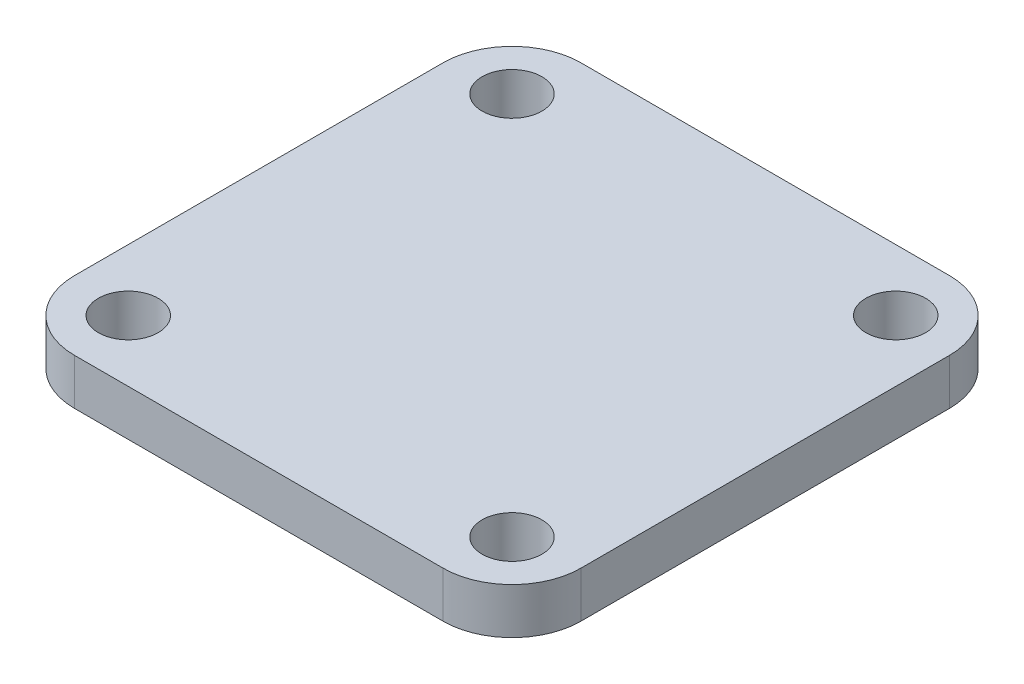
ISO-10303-21;
HEADER;
FILE_DESCRIPTION(('STEP AP214'),'2;1');
FILE_NAME('part.step','',(''),(''),'','','');
FILE_SCHEMA(('AUTOMOTIVE_DESIGN { 1 0 10303 214 1 1 1 1 }'));
ENDSEC;
DATA;
#1=APPLICATION_CONTEXT('core data for automotive mechanical design processes');
#2=APPLICATION_PROTOCOL_DEFINITION('international standard','automotive_design',2000,#1);
#3=PRODUCT_CONTEXT('',#1,'mechanical');
#4=PRODUCT('Part','Part','',(#3));
#5=PRODUCT_RELATED_PRODUCT_CATEGORY('part','',(#4));
#6=PRODUCT_DEFINITION_FORMATION('','',#4);
#7=PRODUCT_DEFINITION_CONTEXT('part definition',#1,'design');
#8=PRODUCT_DEFINITION('design','',#6,#7);
#9=PRODUCT_DEFINITION_SHAPE('','',#8);
#10=(LENGTH_UNIT() NAMED_UNIT(*) SI_UNIT(.MILLI.,.METRE.));
#11=(NAMED_UNIT(*) PLANE_ANGLE_UNIT() SI_UNIT($,.RADIAN.));
#12=(NAMED_UNIT(*) SI_UNIT($,.STERADIAN.) SOLID_ANGLE_UNIT());
#13=UNCERTAINTY_MEASURE_WITH_UNIT(LENGTH_MEASURE(1.E-05),#10,'distance_accuracy_value','');
#14=(GEOMETRIC_REPRESENTATION_CONTEXT(3) GLOBAL_UNCERTAINTY_ASSIGNED_CONTEXT((#13)) GLOBAL_UNIT_ASSIGNED_CONTEXT((#10,
#11,#12)) REPRESENTATION_CONTEXT('',''));
#15=CARTESIAN_POINT('',(0.,0.,0.));
#16=DIRECTION('',(0.,0.,1.));
#17=DIRECTION('',(1.,0.,0.));
#18=AXIS2_PLACEMENT_3D('',#15,#16,#17);
#19=CARTESIAN_POINT('',(0.,5.,0.));
#20=DIRECTION('',(0.,-1.,0.));
#21=DIRECTION('',(0.,0.,-1.));
#22=AXIS2_PLACEMENT_3D('',#19,#20,#21);
#23=PLANE('',#22);
#24=DIRECTION('',(-1.,0.,0.));
#25=VECTOR('',#24,1.);
#26=CARTESIAN_POINT('',(-27.55,5.,-27.55));
#27=LINE('',#26,#25);
#28=CARTESIAN_POINT('',(20.05,5.,-27.55));
#29=VERTEX_POINT('',#28);
#30=CARTESIAN_POINT('',(-20.05,5.,-27.55));
#31=VERTEX_POINT('',#30);
#32=EDGE_CURVE('E194',#29,#31,#27,.T.);
#33=ORIENTED_EDGE('',*,*,#32,.T.);
#34=CARTESIAN_POINT('',(-20.05,5.,-20.05));
#35=DIRECTION('',(0.,-1.,0.));
#36=DIRECTION('',(0.,0.,-1.));
#37=AXIS2_PLACEMENT_3D('',#34,#35,#36);
#38=CIRCLE('',#37,7.5);
#39=CARTESIAN_POINT('',(-27.55,5.,-20.05));
#40=VERTEX_POINT('',#39);
#41=EDGE_CURVE('E170',#31,#40,#38,.F.);
#42=ORIENTED_EDGE('',*,*,#41,.T.);
#43=DIRECTION('',(0.,0.,1.));
#44=VECTOR('',#43,1.);
#45=CARTESIAN_POINT('',(-27.55,5.,27.55));
#46=LINE('',#45,#44);
#47=CARTESIAN_POINT('',(-27.55,5.,20.05));
#48=VERTEX_POINT('',#47);
#49=EDGE_CURVE('E127',#40,#48,#46,.T.);
#50=ORIENTED_EDGE('',*,*,#49,.T.);
#51=CARTESIAN_POINT('',(-20.05,5.,20.05));
#52=DIRECTION('',(0.,-1.,0.));
#53=DIRECTION('',(0.,0.,-1.));
#54=AXIS2_PLACEMENT_3D('',#51,#52,#53);
#55=CIRCLE('',#54,7.5);
#56=CARTESIAN_POINT('',(-20.05,5.,27.55));
#57=VERTEX_POINT('',#56);
#58=EDGE_CURVE('E62',#48,#57,#55,.F.);
#59=ORIENTED_EDGE('',*,*,#58,.T.);
#60=DIRECTION('',(1.,0.,0.));
#61=VECTOR('',#60,1.);
#62=CARTESIAN_POINT('',(-27.55,5.,27.55));
#63=LINE('',#62,#61);
#64=CARTESIAN_POINT('',(20.05,5.,27.55));
#65=VERTEX_POINT('',#64);
#66=EDGE_CURVE('E148',#57,#65,#63,.T.);
#67=ORIENTED_EDGE('',*,*,#66,.T.);
#68=CARTESIAN_POINT('',(20.05,5.,20.05));
#69=DIRECTION('',(0.,-1.,0.));
#70=DIRECTION('',(0.,0.,-1.));
#71=AXIS2_PLACEMENT_3D('',#68,#69,#70);
#72=CIRCLE('',#71,7.5);
#73=CARTESIAN_POINT('',(27.55,5.,20.05));
#74=VERTEX_POINT('',#73);
#75=EDGE_CURVE('E165',#65,#74,#72,.F.);
#76=ORIENTED_EDGE('',*,*,#75,.T.);
#77=DIRECTION('',(0.,0.,-1.));
#78=VECTOR('',#77,1.);
#79=CARTESIAN_POINT('',(27.55,5.,27.55));
#80=LINE('',#79,#78);
#81=CARTESIAN_POINT('',(27.55,5.,-20.05));
#82=VERTEX_POINT('',#81);
#83=EDGE_CURVE('E141',#74,#82,#80,.T.);
#84=ORIENTED_EDGE('',*,*,#83,.T.);
#85=CARTESIAN_POINT('',(20.05,5.,-20.05));
#86=DIRECTION('',(0.,-1.,0.));
#87=DIRECTION('',(0.,0.,-1.));
#88=AXIS2_PLACEMENT_3D('',#85,#86,#87);
#89=CIRCLE('',#88,7.5);
#90=EDGE_CURVE('E162',#82,#29,#89,.F.);
#91=ORIENTED_EDGE('',*,*,#90,.T.);
#92=EDGE_LOOP('',(#33,#42,#50,#59,#67,#76,#84,#91));
#93=FACE_BOUND('',#92,.T.);
#94=CARTESIAN_POINT('',(20.87,5.,20.87));
#95=DIRECTION('',(0.,1.,0.));
#96=DIRECTION('',(0.,0.,1.));
#97=AXIS2_PLACEMENT_3D('',#94,#95,#96);
#98=CIRCLE('',#97,3.25);
#99=CARTESIAN_POINT('',(20.87,5.,24.12));
#100=VERTEX_POINT('',#99);
#101=EDGE_CURVE('E200',#100,#100,#98,.T.);
#102=ORIENTED_EDGE('',*,*,#101,.F.);
#103=EDGE_LOOP('',(#102));
#104=FACE_BOUND('',#103,.T.);
#105=CARTESIAN_POINT('',(-20.87,5.,20.87));
#106=DIRECTION('',(0.,1.,0.));
#107=DIRECTION('',(0.,0.,1.));
#108=AXIS2_PLACEMENT_3D('',#105,#106,#107);
#109=CIRCLE('',#108,3.25);
#110=CARTESIAN_POINT('',(-20.87,5.,24.12));
#111=VERTEX_POINT('',#110);
#112=EDGE_CURVE('E214',#111,#111,#109,.T.);
#113=ORIENTED_EDGE('',*,*,#112,.F.);
#114=EDGE_LOOP('',(#113));
#115=FACE_BOUND('',#114,.T.);
#116=CARTESIAN_POINT('',(-20.87,5.,-20.87));
#117=DIRECTION('',(0.,1.,0.));
#118=DIRECTION('',(0.,0.,1.));
#119=AXIS2_PLACEMENT_3D('',#116,#117,#118);
#120=CIRCLE('',#119,3.25);
#121=CARTESIAN_POINT('',(-20.87,5.,-17.62));
#122=VERTEX_POINT('',#121);
#123=EDGE_CURVE('E220',#122,#122,#120,.T.);
#124=ORIENTED_EDGE('',*,*,#123,.F.);
#125=EDGE_LOOP('',(#124));
#126=FACE_BOUND('',#125,.T.);
#127=CARTESIAN_POINT('',(20.87,5.,-20.87));
#128=DIRECTION('',(0.,1.,0.));
#129=DIRECTION('',(0.,0.,1.));
#130=AXIS2_PLACEMENT_3D('',#127,#128,#129);
#131=CIRCLE('',#130,3.25);
#132=CARTESIAN_POINT('',(20.87,5.,-17.62));
#133=VERTEX_POINT('',#132);
#134=EDGE_CURVE('E228',#133,#133,#131,.T.);
#135=ORIENTED_EDGE('',*,*,#134,.F.);
#136=EDGE_LOOP('',(#135));
#137=FACE_BOUND('',#136,.T.);
#138=ADVANCED_FACE('F39',(#93,#104,#115,#126,#137),#23,.F.);
#139=CARTESIAN_POINT('',(0.,0.,0.));
#140=DIRECTION('',(0.,-1.,0.));
#141=DIRECTION('',(0.,0.,-1.));
#142=AXIS2_PLACEMENT_3D('',#139,#140,#141);
#143=PLANE('',#142);
#144=CARTESIAN_POINT('',(-20.87,0.,-20.87));
#145=DIRECTION('',(0.,1.,0.));
#146=DIRECTION('',(0.,0.,1.));
#147=AXIS2_PLACEMENT_3D('',#144,#145,#146);
#148=CIRCLE('',#147,3.25);
#149=CARTESIAN_POINT('',(-20.87,0.,-17.62));
#150=VERTEX_POINT('',#149);
#151=EDGE_CURVE('E224',#150,#150,#148,.T.);
#152=ORIENTED_EDGE('',*,*,#151,.T.);
#153=EDGE_LOOP('',(#152));
#154=FACE_BOUND('',#153,.T.);
#155=CARTESIAN_POINT('',(20.87,0.,20.87));
#156=DIRECTION('',(0.,1.,0.));
#157=DIRECTION('',(0.,0.,1.));
#158=AXIS2_PLACEMENT_3D('',#155,#156,#157);
#159=CIRCLE('',#158,3.25);
#160=CARTESIAN_POINT('',(20.87,0.,24.12));
#161=VERTEX_POINT('',#160);
#162=EDGE_CURVE('E203',#161,#161,#159,.T.);
#163=ORIENTED_EDGE('',*,*,#162,.T.);
#164=EDGE_LOOP('',(#163));
#165=FACE_BOUND('',#164,.T.);
#166=DIRECTION('',(0.,0.,1.));
#167=VECTOR('',#166,1.);
#168=CARTESIAN_POINT('',(-27.55,0.,27.55));
#169=LINE('',#168,#167);
#170=CARTESIAN_POINT('',(-27.55,0.,-20.05));
#171=VERTEX_POINT('',#170);
#172=CARTESIAN_POINT('',(-27.55,0.,20.05));
#173=VERTEX_POINT('',#172);
#174=EDGE_CURVE('E125',#171,#173,#169,.T.);
#175=ORIENTED_EDGE('',*,*,#174,.F.);
#176=CARTESIAN_POINT('',(-20.05,0.,-20.05));
#177=DIRECTION('',(0.,-1.,0.));
#178=DIRECTION('',(0.,0.,-1.));
#179=AXIS2_PLACEMENT_3D('',#176,#177,#178);
#180=CIRCLE('',#179,7.5);
#181=CARTESIAN_POINT('',(-20.05,0.,-27.55));
#182=VERTEX_POINT('',#181);
#183=EDGE_CURVE('E107',#171,#182,#180,.T.);
#184=ORIENTED_EDGE('',*,*,#183,.T.);
#185=DIRECTION('',(-1.,0.,0.));
#186=VECTOR('',#185,1.);
#187=CARTESIAN_POINT('',(-27.55,0.,-27.55));
#188=LINE('',#187,#186);
#189=CARTESIAN_POINT('',(20.05,0.,-27.55));
#190=VERTEX_POINT('',#189);
#191=EDGE_CURVE('E137',#190,#182,#188,.T.);
#192=ORIENTED_EDGE('',*,*,#191,.F.);
#193=CARTESIAN_POINT('',(20.05,0.,-20.05));
#194=DIRECTION('',(0.,-1.,0.));
#195=DIRECTION('',(0.,0.,-1.));
#196=AXIS2_PLACEMENT_3D('',#193,#194,#195);
#197=CIRCLE('',#196,7.5);
#198=CARTESIAN_POINT('',(27.55,0.,-20.05));
#199=VERTEX_POINT('',#198);
#200=EDGE_CURVE('E129',#190,#199,#197,.T.);
#201=ORIENTED_EDGE('',*,*,#200,.T.);
#202=DIRECTION('',(0.,0.,-1.));
#203=VECTOR('',#202,1.);
#204=CARTESIAN_POINT('',(27.55,0.,27.55));
#205=LINE('',#204,#203);
#206=CARTESIAN_POINT('',(27.55,0.,20.05));
#207=VERTEX_POINT('',#206);
#208=EDGE_CURVE('E143',#207,#199,#205,.T.);
#209=ORIENTED_EDGE('',*,*,#208,.F.);
#210=CARTESIAN_POINT('',(20.05,0.,20.05));
#211=DIRECTION('',(0.,-1.,0.));
#212=DIRECTION('',(0.,0.,-1.));
#213=AXIS2_PLACEMENT_3D('',#210,#211,#212);
#214=CIRCLE('',#213,7.5);
#215=CARTESIAN_POINT('',(20.05,0.,27.55));
#216=VERTEX_POINT('',#215);
#217=EDGE_CURVE('E152',#207,#216,#214,.T.);
#218=ORIENTED_EDGE('',*,*,#217,.T.);
#219=DIRECTION('',(1.,0.,0.));
#220=VECTOR('',#219,1.);
#221=CARTESIAN_POINT('',(-27.55,0.,27.55));
#222=LINE('',#221,#220);
#223=CARTESIAN_POINT('',(-20.05,0.,27.55));
#224=VERTEX_POINT('',#223);
#225=EDGE_CURVE('E136',#224,#216,#222,.T.);
#226=ORIENTED_EDGE('',*,*,#225,.F.);
#227=CARTESIAN_POINT('',(-20.05,0.,20.05));
#228=DIRECTION('',(0.,-1.,0.));
#229=DIRECTION('',(0.,0.,-1.));
#230=AXIS2_PLACEMENT_3D('',#227,#228,#229);
#231=CIRCLE('',#230,7.5);
#232=EDGE_CURVE('E119',#224,#173,#231,.T.);
#233=ORIENTED_EDGE('',*,*,#232,.T.);
#234=EDGE_LOOP('',(#175,#184,#192,#201,#209,#218,#226,#233));
#235=FACE_BOUND('',#234,.T.);
#236=CARTESIAN_POINT('',(-20.87,0.,20.87));
#237=DIRECTION('',(0.,1.,0.));
#238=DIRECTION('',(0.,0.,1.));
#239=AXIS2_PLACEMENT_3D('',#236,#237,#238);
#240=CIRCLE('',#239,3.25);
#241=CARTESIAN_POINT('',(-20.87,0.,24.12));
#242=VERTEX_POINT('',#241);
#243=EDGE_CURVE('E216',#242,#242,#240,.T.);
#244=ORIENTED_EDGE('',*,*,#243,.T.);
#245=EDGE_LOOP('',(#244));
#246=FACE_BOUND('',#245,.T.);
#247=CARTESIAN_POINT('',(20.87,0.,-20.87));
#248=DIRECTION('',(0.,1.,0.));
#249=DIRECTION('',(0.,0.,1.));
#250=AXIS2_PLACEMENT_3D('',#247,#248,#249);
#251=CIRCLE('',#250,3.25);
#252=CARTESIAN_POINT('',(20.87,0.,-17.62));
#253=VERTEX_POINT('',#252);
#254=EDGE_CURVE('E232',#253,#253,#251,.T.);
#255=ORIENTED_EDGE('',*,*,#254,.T.);
#256=EDGE_LOOP('',(#255));
#257=FACE_BOUND('',#256,.T.);
#258=ADVANCED_FACE('F132',(#154,#165,#235,#246,#257),#143,.T.);
#259=CARTESIAN_POINT('',(27.55,5.,27.55));
#260=DIRECTION('',(-1.,0.,0.));
#261=DIRECTION('',(0.,0.,1.));
#262=AXIS2_PLACEMENT_3D('',#259,#260,#261);
#263=PLANE('',#262);
#264=ORIENTED_EDGE('',*,*,#83,.F.);
#265=DIRECTION('',(0.,-1.,0.));
#266=VECTOR('',#265,1.);
#267=CARTESIAN_POINT('',(27.55,5.,20.05));
#268=LINE('',#267,#266);
#269=EDGE_CURVE('E11',#74,#207,#268,.T.);
#270=ORIENTED_EDGE('',*,*,#269,.T.);
#271=ORIENTED_EDGE('',*,*,#208,.T.);
#272=DIRECTION('',(0.,-1.,0.));
#273=VECTOR('',#272,1.);
#274=CARTESIAN_POINT('',(27.55,5.,-20.05));
#275=LINE('',#274,#273);
#276=EDGE_CURVE('E48',#199,#82,#275,.F.);
#277=ORIENTED_EDGE('',*,*,#276,.T.);
#278=EDGE_LOOP('',(#264,#270,#271,#277));
#279=FACE_BOUND('',#278,.T.);
#280=ADVANCED_FACE('F184',(#279),#263,.F.);
#281=CARTESIAN_POINT('',(-27.55,5.,-27.55));
#282=DIRECTION('',(0.,0.,1.));
#283=DIRECTION('',(1.,0.,0.));
#284=AXIS2_PLACEMENT_3D('',#281,#282,#283);
#285=PLANE('',#284);
#286=ORIENTED_EDGE('',*,*,#191,.T.);
#287=DIRECTION('',(0.,-1.,0.));
#288=VECTOR('',#287,1.);
#289=CARTESIAN_POINT('',(-20.05,5.,-27.55));
#290=LINE('',#289,#288);
#291=EDGE_CURVE('E112',#182,#31,#290,.F.);
#292=ORIENTED_EDGE('',*,*,#291,.T.);
#293=ORIENTED_EDGE('',*,*,#32,.F.);
#294=DIRECTION('',(0.,-1.,0.));
#295=VECTOR('',#294,1.);
#296=CARTESIAN_POINT('',(20.05,5.,-27.55));
#297=LINE('',#296,#295);
#298=EDGE_CURVE('E118',#29,#190,#297,.T.);
#299=ORIENTED_EDGE('',*,*,#298,.T.);
#300=EDGE_LOOP('',(#286,#292,#293,#299));
#301=FACE_BOUND('',#300,.T.);
#302=ADVANCED_FACE('F198',(#301),#285,.F.);
#303=CARTESIAN_POINT('',(-27.55,5.,27.55));
#304=DIRECTION('',(1.,0.,0.));
#305=DIRECTION('',(0.,0.,-1.));
#306=AXIS2_PLACEMENT_3D('',#303,#304,#305);
#307=PLANE('',#306);
#308=ORIENTED_EDGE('',*,*,#49,.F.);
#309=DIRECTION('',(0.,-1.,0.));
#310=VECTOR('',#309,1.);
#311=CARTESIAN_POINT('',(-27.55,5.,-20.05));
#312=LINE('',#311,#310);
#313=EDGE_CURVE('E111',#40,#171,#312,.T.);
#314=ORIENTED_EDGE('',*,*,#313,.T.);
#315=ORIENTED_EDGE('',*,*,#174,.T.);
#316=DIRECTION('',(0.,-1.,0.));
#317=VECTOR('',#316,1.);
#318=CARTESIAN_POINT('',(-27.55,5.,20.05));
#319=LINE('',#318,#317);
#320=EDGE_CURVE('E130',#173,#48,#319,.F.);
#321=ORIENTED_EDGE('',*,*,#320,.T.);
#322=EDGE_LOOP('',(#308,#314,#315,#321));
#323=FACE_BOUND('',#322,.T.);
#324=ADVANCED_FACE('F124',(#323),#307,.F.);
#325=CARTESIAN_POINT('',(-27.55,5.,27.55));
#326=DIRECTION('',(0.,0.,-1.));
#327=DIRECTION('',(-1.,0.,0.));
#328=AXIS2_PLACEMENT_3D('',#325,#326,#327);
#329=PLANE('',#328);
#330=ORIENTED_EDGE('',*,*,#66,.F.);
#331=DIRECTION('',(0.,-1.,0.));
#332=VECTOR('',#331,1.);
#333=CARTESIAN_POINT('',(-20.05,5.,27.55));
#334=LINE('',#333,#332);
#335=EDGE_CURVE('E175',#57,#224,#334,.T.);
#336=ORIENTED_EDGE('',*,*,#335,.T.);
#337=ORIENTED_EDGE('',*,*,#225,.T.);
#338=DIRECTION('',(0.,-1.,0.));
#339=VECTOR('',#338,1.);
#340=CARTESIAN_POINT('',(20.05,5.,27.55));
#341=LINE('',#340,#339);
#342=EDGE_CURVE('E55',#216,#65,#341,.F.);
#343=ORIENTED_EDGE('',*,*,#342,.T.);
#344=EDGE_LOOP('',(#330,#336,#337,#343));
#345=FACE_BOUND('',#344,.T.);
#346=ADVANCED_FACE('F254',(#345),#329,.F.);
#347=CARTESIAN_POINT('',(20.87,5.,20.87));
#348=DIRECTION('',(0.,-1.,0.));
#349=DIRECTION('',(0.,0.,-1.));
#350=AXIS2_PLACEMENT_3D('',#347,#348,#349);
#351=CYLINDRICAL_SURFACE('',#350,3.25);
#352=ORIENTED_EDGE('',*,*,#101,.T.);
#353=EDGE_LOOP('',(#352));
#354=FACE_BOUND('',#353,.T.);
#355=ORIENTED_EDGE('',*,*,#162,.F.);
#356=EDGE_LOOP('',(#355));
#357=FACE_BOUND('',#356,.T.);
#358=ADVANCED_FACE('F251',(#354,#357),#351,.F.);
#359=CARTESIAN_POINT('',(-20.87,5.,20.87));
#360=DIRECTION('',(0.,-1.,0.));
#361=DIRECTION('',(0.,0.,-1.));
#362=AXIS2_PLACEMENT_3D('',#359,#360,#361);
#363=CYLINDRICAL_SURFACE('',#362,3.25);
#364=ORIENTED_EDGE('',*,*,#112,.T.);
#365=EDGE_LOOP('',(#364));
#366=FACE_BOUND('',#365,.T.);
#367=ORIENTED_EDGE('',*,*,#243,.F.);
#368=EDGE_LOOP('',(#367));
#369=FACE_BOUND('',#368,.T.);
#370=ADVANCED_FACE('F346',(#366,#369),#363,.F.);
#371=CARTESIAN_POINT('',(-20.87,5.,-20.87));
#372=DIRECTION('',(0.,-1.,0.));
#373=DIRECTION('',(0.,0.,-1.));
#374=AXIS2_PLACEMENT_3D('',#371,#372,#373);
#375=CYLINDRICAL_SURFACE('',#374,3.25);
#376=ORIENTED_EDGE('',*,*,#123,.T.);
#377=EDGE_LOOP('',(#376));
#378=FACE_BOUND('',#377,.T.);
#379=ORIENTED_EDGE('',*,*,#151,.F.);
#380=EDGE_LOOP('',(#379));
#381=FACE_BOUND('',#380,.T.);
#382=ADVANCED_FACE('F337',(#378,#381),#375,.F.);
#383=CARTESIAN_POINT('',(20.87,5.,-20.87));
#384=DIRECTION('',(0.,-1.,0.));
#385=DIRECTION('',(0.,0.,-1.));
#386=AXIS2_PLACEMENT_3D('',#383,#384,#385);
#387=CYLINDRICAL_SURFACE('',#386,3.25);
#388=ORIENTED_EDGE('',*,*,#134,.T.);
#389=EDGE_LOOP('',(#388));
#390=FACE_BOUND('',#389,.T.);
#391=ORIENTED_EDGE('',*,*,#254,.F.);
#392=EDGE_LOOP('',(#391));
#393=FACE_BOUND('',#392,.T.);
#394=ADVANCED_FACE('F240',(#390,#393),#387,.F.);
#395=CARTESIAN_POINT('',(-20.05,5.,-20.05));
#396=DIRECTION('',(0.,-1.,0.));
#397=DIRECTION('',(0.,0.,-1.));
#398=AXIS2_PLACEMENT_3D('',#395,#396,#397);
#399=CYLINDRICAL_SURFACE('',#398,7.5);
#400=ORIENTED_EDGE('',*,*,#41,.F.);
#401=ORIENTED_EDGE('',*,*,#291,.F.);
#402=ORIENTED_EDGE('',*,*,#183,.F.);
#403=ORIENTED_EDGE('',*,*,#313,.F.);
#404=EDGE_LOOP('',(#400,#401,#402,#403));
#405=FACE_BOUND('',#404,.T.);
#406=ADVANCED_FACE('F110',(#405),#399,.T.);
#407=CARTESIAN_POINT('',(-20.05,5.,20.05));
#408=DIRECTION('',(0.,-1.,0.));
#409=DIRECTION('',(0.,0.,-1.));
#410=AXIS2_PLACEMENT_3D('',#407,#408,#409);
#411=CYLINDRICAL_SURFACE('',#410,7.5);
#412=ORIENTED_EDGE('',*,*,#58,.F.);
#413=ORIENTED_EDGE('',*,*,#320,.F.);
#414=ORIENTED_EDGE('',*,*,#232,.F.);
#415=ORIENTED_EDGE('',*,*,#335,.F.);
#416=EDGE_LOOP('',(#412,#413,#414,#415));
#417=FACE_BOUND('',#416,.T.);
#418=ADVANCED_FACE('F265',(#417),#411,.T.);
#419=CARTESIAN_POINT('',(20.05,5.,20.05));
#420=DIRECTION('',(0.,-1.,0.));
#421=DIRECTION('',(0.,0.,-1.));
#422=AXIS2_PLACEMENT_3D('',#419,#420,#421);
#423=CYLINDRICAL_SURFACE('',#422,7.5);
#424=ORIENTED_EDGE('',*,*,#75,.F.);
#425=ORIENTED_EDGE('',*,*,#342,.F.);
#426=ORIENTED_EDGE('',*,*,#217,.F.);
#427=ORIENTED_EDGE('',*,*,#269,.F.);
#428=EDGE_LOOP('',(#424,#425,#426,#427));
#429=FACE_BOUND('',#428,.T.);
#430=ADVANCED_FACE('F267',(#429),#423,.T.);
#431=CARTESIAN_POINT('',(20.05,5.,-20.05));
#432=DIRECTION('',(0.,-1.,0.));
#433=DIRECTION('',(0.,0.,-1.));
#434=AXIS2_PLACEMENT_3D('',#431,#432,#433);
#435=CYLINDRICAL_SURFACE('',#434,7.5);
#436=ORIENTED_EDGE('',*,*,#90,.F.);
#437=ORIENTED_EDGE('',*,*,#276,.F.);
#438=ORIENTED_EDGE('',*,*,#200,.F.);
#439=ORIENTED_EDGE('',*,*,#298,.F.);
#440=EDGE_LOOP('',(#436,#437,#438,#439));
#441=FACE_BOUND('',#440,.T.);
#442=ADVANCED_FACE('F41',(#441),#435,.T.);
#443=CLOSED_SHELL('',(#138,#258,#280,#302,#324,#346,#358,#370,#382,#394,#406,#418,#430,#442));
#444=MANIFOLD_SOLID_BREP('B2',#443);
#445=ADVANCED_BREP_SHAPE_REPRESENTATION('',(#18,#444),#14);
#446=SHAPE_DEFINITION_REPRESENTATION(#9,#445);
ENDSEC;
END-ISO-10303-21;
